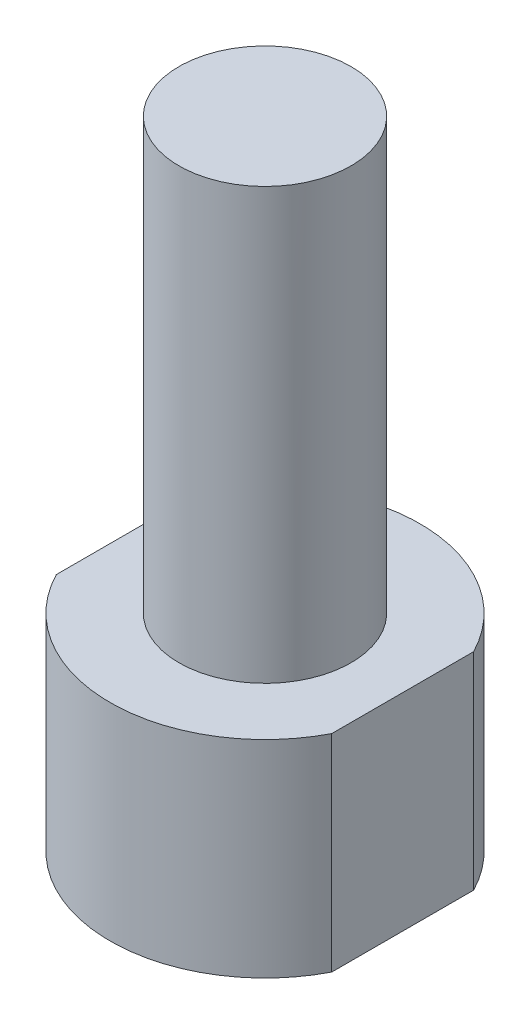
ISO-10303-21;
HEADER;
FILE_DESCRIPTION(('STEP AP214'),'2;1');
FILE_NAME('part.step','',(''),(''),'','','');
FILE_SCHEMA(('AUTOMOTIVE_DESIGN { 1 0 10303 214 1 1 1 1 }'));
ENDSEC;
DATA;
#1=APPLICATION_CONTEXT('core data for automotive mechanical design processes');
#2=APPLICATION_PROTOCOL_DEFINITION('international standard','automotive_design',2000,#1);
#3=PRODUCT_CONTEXT('',#1,'mechanical');
#4=PRODUCT('Part','Part','',(#3));
#5=PRODUCT_RELATED_PRODUCT_CATEGORY('part','',(#4));
#6=PRODUCT_DEFINITION_FORMATION('','',#4);
#7=PRODUCT_DEFINITION_CONTEXT('part definition',#1,'design');
#8=PRODUCT_DEFINITION('design','',#6,#7);
#9=PRODUCT_DEFINITION_SHAPE('','',#8);
#10=(LENGTH_UNIT() NAMED_UNIT(*) SI_UNIT(.MILLI.,.METRE.));
#11=(NAMED_UNIT(*) PLANE_ANGLE_UNIT() SI_UNIT($,.RADIAN.));
#12=(NAMED_UNIT(*) SI_UNIT($,.STERADIAN.) SOLID_ANGLE_UNIT());
#13=UNCERTAINTY_MEASURE_WITH_UNIT(LENGTH_MEASURE(1.E-05),#10,'distance_accuracy_value','');
#14=(GEOMETRIC_REPRESENTATION_CONTEXT(3) GLOBAL_UNCERTAINTY_ASSIGNED_CONTEXT((#13)) GLOBAL_UNIT_ASSIGNED_CONTEXT((#10,
#11,#12)) REPRESENTATION_CONTEXT('',''));
#15=CARTESIAN_POINT('',(0.,0.,0.));
#16=DIRECTION('',(0.,0.,1.));
#17=DIRECTION('',(1.,0.,0.));
#18=AXIS2_PLACEMENT_3D('',#15,#16,#17);
#19=CARTESIAN_POINT('',(0.,0.,0.));
#20=DIRECTION('',(0.,1.,0.));
#21=DIRECTION('',(0.,0.,1.));
#22=AXIS2_PLACEMENT_3D('',#19,#20,#21);
#23=CYLINDRICAL_SURFACE('',#22,9.);
#24=CARTESIAN_POINT('',(0.,12.,0.));
#25=DIRECTION('',(0.,1.,0.));
#26=DIRECTION('',(0.,0.,1.));
#27=AXIS2_PLACEMENT_3D('',#24,#25,#26);
#28=CIRCLE('',#27,9.);
#29=CARTESIAN_POINT('',(8.,12.,-4.12310562561766));
#30=VERTEX_POINT('',#29);
#31=CARTESIAN_POINT('',(-8.,12.,-4.12310562561766));
#32=VERTEX_POINT('',#31);
#33=EDGE_CURVE('E99',#30,#32,#28,.T.);
#34=ORIENTED_EDGE('',*,*,#33,.F.);
#35=DIRECTION('',(0.,1.,0.));
#36=VECTOR('',#35,1.);
#37=CARTESIAN_POINT('',(8.,0.,-4.12310562561766));
#38=LINE('',#37,#36);
#39=CARTESIAN_POINT('',(8.,0.,-4.12310562561766));
#40=VERTEX_POINT('',#39);
#41=EDGE_CURVE('E40',#40,#30,#38,.T.);
#42=ORIENTED_EDGE('',*,*,#41,.F.);
#43=CARTESIAN_POINT('',(0.,0.,0.));
#44=DIRECTION('',(0.,1.,0.));
#45=DIRECTION('',(0.,0.,1.));
#46=AXIS2_PLACEMENT_3D('',#43,#44,#45);
#47=CIRCLE('',#46,9.);
#48=CARTESIAN_POINT('',(-8.,0.,-4.12310562561766));
#49=VERTEX_POINT('',#48);
#50=EDGE_CURVE('E92',#40,#49,#47,.T.);
#51=ORIENTED_EDGE('',*,*,#50,.T.);
#52=DIRECTION('',(0.,1.,0.));
#53=VECTOR('',#52,1.);
#54=CARTESIAN_POINT('',(-8.,0.,-4.12310562561766));
#55=LINE('',#54,#53);
#56=EDGE_CURVE('E75',#49,#32,#55,.T.);
#57=ORIENTED_EDGE('',*,*,#56,.T.);
#58=EDGE_LOOP('',(#34,#42,#51,#57));
#59=FACE_BOUND('',#58,.T.);
#60=ADVANCED_FACE('F32',(#59),#23,.T.);
#61=CARTESIAN_POINT('',(8.,0.,4.12310562561767));
#62=DIRECTION('',(1.,0.,0.));
#63=DIRECTION('',(0.,0.,-1.));
#64=AXIS2_PLACEMENT_3D('',#61,#62,#63);
#65=PLANE('',#64);
#66=DIRECTION('',(0.,0.,-1.));
#67=VECTOR('',#66,1.);
#68=CARTESIAN_POINT('',(8.,12.,4.12310562561767));
#69=LINE('',#68,#67);
#70=CARTESIAN_POINT('',(8.,12.,4.12310562561767));
#71=VERTEX_POINT('',#70);
#72=EDGE_CURVE('E94',#71,#30,#69,.T.);
#73=ORIENTED_EDGE('',*,*,#72,.F.);
#74=DIRECTION('',(0.,1.,0.));
#75=VECTOR('',#74,1.);
#76=CARTESIAN_POINT('',(8.,0.,4.12310562561767));
#77=LINE('',#76,#75);
#78=CARTESIAN_POINT('',(8.,0.,4.12310562561767));
#79=VERTEX_POINT('',#78);
#80=EDGE_CURVE('E64',#79,#71,#77,.T.);
#81=ORIENTED_EDGE('',*,*,#80,.F.);
#82=DIRECTION('',(0.,0.,-1.));
#83=VECTOR('',#82,1.);
#84=CARTESIAN_POINT('',(8.,0.,4.12310562561767));
#85=LINE('',#84,#83);
#86=EDGE_CURVE('E89',#79,#40,#85,.T.);
#87=ORIENTED_EDGE('',*,*,#86,.T.);
#88=ORIENTED_EDGE('',*,*,#41,.T.);
#89=EDGE_LOOP('',(#73,#81,#87,#88));
#90=FACE_BOUND('',#89,.T.);
#91=ADVANCED_FACE('F111',(#90),#65,.T.);
#92=CARTESIAN_POINT('',(0.,0.,0.));
#93=DIRECTION('',(0.,1.,0.));
#94=DIRECTION('',(0.,0.,1.));
#95=AXIS2_PLACEMENT_3D('',#92,#93,#94);
#96=CYLINDRICAL_SURFACE('',#95,9.);
#97=CARTESIAN_POINT('',(0.,12.,0.));
#98=DIRECTION('',(0.,1.,0.));
#99=DIRECTION('',(0.,0.,1.));
#100=AXIS2_PLACEMENT_3D('',#97,#98,#99);
#101=CIRCLE('',#100,9.);
#102=CARTESIAN_POINT('',(-8.,12.,4.12310562561767));
#103=VERTEX_POINT('',#102);
#104=EDGE_CURVE('E83',#103,#71,#101,.T.);
#105=ORIENTED_EDGE('',*,*,#104,.F.);
#106=DIRECTION('',(0.,1.,0.));
#107=VECTOR('',#106,1.);
#108=CARTESIAN_POINT('',(-8.,0.,4.12310562561767));
#109=LINE('',#108,#107);
#110=CARTESIAN_POINT('',(-8.,0.,4.12310562561767));
#111=VERTEX_POINT('',#110);
#112=EDGE_CURVE('E78',#111,#103,#109,.T.);
#113=ORIENTED_EDGE('',*,*,#112,.F.);
#114=CARTESIAN_POINT('',(0.,0.,0.));
#115=DIRECTION('',(0.,1.,0.));
#116=DIRECTION('',(0.,0.,1.));
#117=AXIS2_PLACEMENT_3D('',#114,#115,#116);
#118=CIRCLE('',#117,9.);
#119=EDGE_CURVE('E81',#111,#79,#118,.T.);
#120=ORIENTED_EDGE('',*,*,#119,.T.);
#121=ORIENTED_EDGE('',*,*,#80,.T.);
#122=EDGE_LOOP('',(#105,#113,#120,#121));
#123=FACE_BOUND('',#122,.T.);
#124=ADVANCED_FACE('F80',(#123),#96,.T.);
#125=CARTESIAN_POINT('',(-8.,0.,-4.12310562561766));
#126=DIRECTION('',(-1.,0.,0.));
#127=DIRECTION('',(0.,0.,1.));
#128=AXIS2_PLACEMENT_3D('',#125,#126,#127);
#129=PLANE('',#128);
#130=DIRECTION('',(0.,0.,1.));
#131=VECTOR('',#130,1.);
#132=CARTESIAN_POINT('',(-8.,12.,-4.12310562561766));
#133=LINE('',#132,#131);
#134=EDGE_CURVE('E102',#32,#103,#133,.T.);
#135=ORIENTED_EDGE('',*,*,#134,.F.);
#136=ORIENTED_EDGE('',*,*,#56,.F.);
#137=DIRECTION('',(0.,0.,1.));
#138=VECTOR('',#137,1.);
#139=CARTESIAN_POINT('',(-8.,0.,-4.12310562561766));
#140=LINE('',#139,#138);
#141=EDGE_CURVE('E88',#49,#111,#140,.T.);
#142=ORIENTED_EDGE('',*,*,#141,.T.);
#143=ORIENTED_EDGE('',*,*,#112,.T.);
#144=EDGE_LOOP('',(#135,#136,#142,#143));
#145=FACE_BOUND('',#144,.T.);
#146=ADVANCED_FACE('F91',(#145),#129,.T.);
#147=CARTESIAN_POINT('',(0.,0.,0.));
#148=DIRECTION('',(0.,1.,0.));
#149=DIRECTION('',(0.,0.,1.));
#150=AXIS2_PLACEMENT_3D('',#147,#148,#149);
#151=PLANE('',#150);
#152=ORIENTED_EDGE('',*,*,#50,.F.);
#153=ORIENTED_EDGE('',*,*,#86,.F.);
#154=ORIENTED_EDGE('',*,*,#119,.F.);
#155=ORIENTED_EDGE('',*,*,#141,.F.);
#156=EDGE_LOOP('',(#152,#153,#154,#155));
#157=FACE_BOUND('',#156,.T.);
#158=ADVANCED_FACE('F87',(#157),#151,.F.);
#159=CARTESIAN_POINT('',(0.,12.,0.));
#160=DIRECTION('',(0.,1.,0.));
#161=DIRECTION('',(0.,0.,1.));
#162=AXIS2_PLACEMENT_3D('',#159,#160,#161);
#163=PLANE('',#162);
#164=CARTESIAN_POINT('',(0.,12.,0.));
#165=DIRECTION('',(0.,1.,0.));
#166=DIRECTION('',(0.,0.,1.));
#167=AXIS2_PLACEMENT_3D('',#164,#165,#166);
#168=CIRCLE('',#167,5.);
#169=CARTESIAN_POINT('',(0.,12.,5.));
#170=VERTEX_POINT('',#169);
#171=EDGE_CURVE('E11',#170,#170,#168,.T.);
#172=ORIENTED_EDGE('',*,*,#171,.F.);
#173=EDGE_LOOP('',(#172));
#174=FACE_BOUND('',#173,.T.);
#175=ORIENTED_EDGE('',*,*,#33,.T.);
#176=ORIENTED_EDGE('',*,*,#134,.T.);
#177=ORIENTED_EDGE('',*,*,#104,.T.);
#178=ORIENTED_EDGE('',*,*,#72,.T.);
#179=EDGE_LOOP('',(#175,#176,#177,#178));
#180=FACE_BOUND('',#179,.T.);
#181=ADVANCED_FACE('F110',(#174,#180),#163,.T.);
#182=CARTESIAN_POINT('',(0.,37.,0.));
#183=DIRECTION('',(0.,-1.,0.));
#184=DIRECTION('',(0.,0.,-1.));
#185=AXIS2_PLACEMENT_3D('',#182,#183,#184);
#186=CYLINDRICAL_SURFACE('',#185,5.);
#187=CARTESIAN_POINT('',(0.,37.,0.));
#188=DIRECTION('',(0.,-1.,0.));
#189=DIRECTION('',(0.,0.,-1.));
#190=AXIS2_PLACEMENT_3D('',#187,#188,#189);
#191=CIRCLE('',#190,5.);
#192=CARTESIAN_POINT('',(0.,37.,-5.));
#193=VERTEX_POINT('',#192);
#194=EDGE_CURVE('E103',#193,#193,#191,.T.);
#195=ORIENTED_EDGE('',*,*,#194,.T.);
#196=EDGE_LOOP('',(#195));
#197=FACE_BOUND('',#196,.T.);
#198=ORIENTED_EDGE('',*,*,#171,.T.);
#199=EDGE_LOOP('',(#198));
#200=FACE_BOUND('',#199,.T.);
#201=ADVANCED_FACE('F128',(#197,#200),#186,.T.);
#202=CARTESIAN_POINT('',(5.,37.,0.));
#203=DIRECTION('',(0.,1.,0.));
#204=DIRECTION('',(0.,0.,1.));
#205=AXIS2_PLACEMENT_3D('',#202,#203,#204);
#206=PLANE('',#205);
#207=ORIENTED_EDGE('',*,*,#194,.F.);
#208=EDGE_LOOP('',(#207));
#209=FACE_BOUND('',#208,.T.);
#210=ADVANCED_FACE('F133',(#209),#206,.T.);
#211=CLOSED_SHELL('',(#60,#91,#124,#146,#158,#181,#201,#210));
#212=MANIFOLD_SOLID_BREP('B2',#211);
#213=ADVANCED_BREP_SHAPE_REPRESENTATION('',(#18,#212),#14);
#214=SHAPE_DEFINITION_REPRESENTATION(#9,#213);
ENDSEC;
END-ISO-10303-21;
